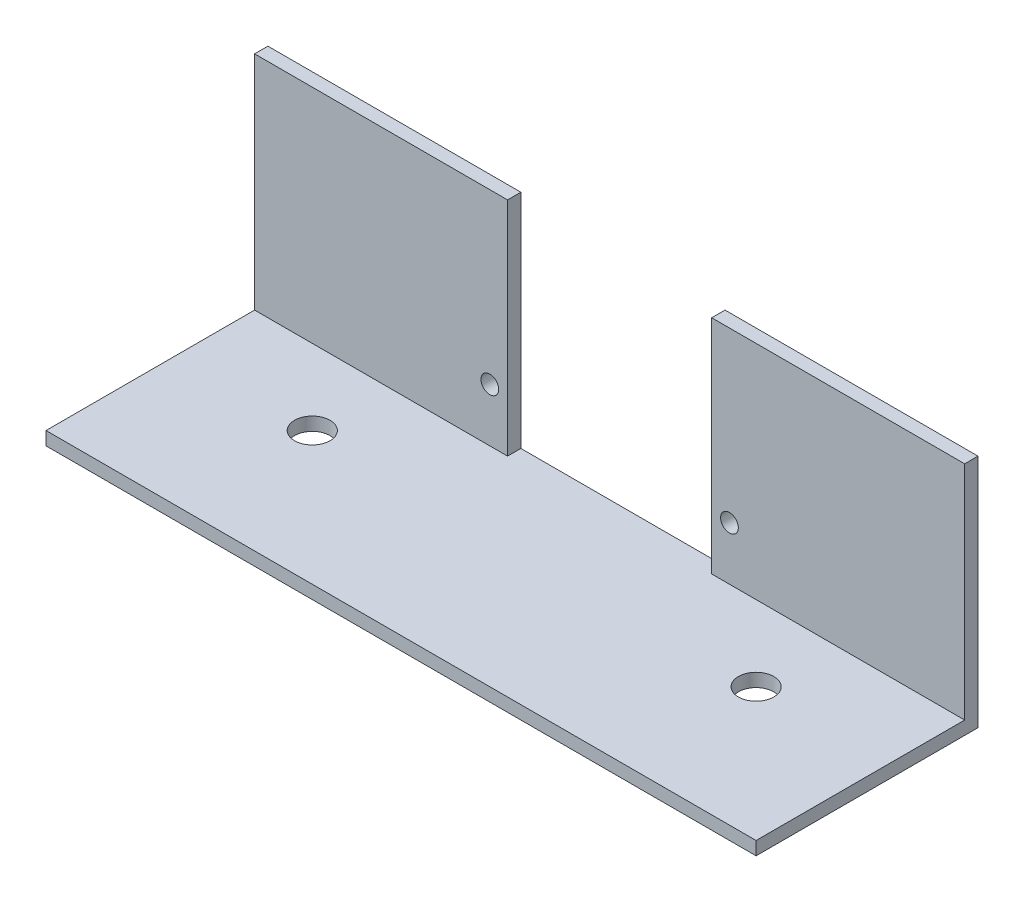
ISO-10303-21;
HEADER;
FILE_DESCRIPTION(('STEP AP214'),'2;1');
FILE_NAME('part.step','',(''),(''),'','','');
FILE_SCHEMA(('AUTOMOTIVE_DESIGN { 1 0 10303 214 1 1 1 1 }'));
ENDSEC;
DATA;
#1=APPLICATION_CONTEXT('core data for automotive mechanical design processes');
#2=APPLICATION_PROTOCOL_DEFINITION('international standard','automotive_design',2000,#1);
#3=PRODUCT_CONTEXT('',#1,'mechanical');
#4=PRODUCT('Part','Part','',(#3));
#5=PRODUCT_RELATED_PRODUCT_CATEGORY('part','',(#4));
#6=PRODUCT_DEFINITION_FORMATION('','',#4);
#7=PRODUCT_DEFINITION_CONTEXT('part definition',#1,'design');
#8=PRODUCT_DEFINITION('design','',#6,#7);
#9=PRODUCT_DEFINITION_SHAPE('','',#8);
#10=(LENGTH_UNIT() NAMED_UNIT(*) SI_UNIT(.MILLI.,.METRE.));
#11=(NAMED_UNIT(*) PLANE_ANGLE_UNIT() SI_UNIT($,.RADIAN.));
#12=(NAMED_UNIT(*) SI_UNIT($,.STERADIAN.) SOLID_ANGLE_UNIT());
#13=UNCERTAINTY_MEASURE_WITH_UNIT(LENGTH_MEASURE(1.E-05),#10,'distance_accuracy_value','');
#14=(GEOMETRIC_REPRESENTATION_CONTEXT(3) GLOBAL_UNCERTAINTY_ASSIGNED_CONTEXT((#13)) GLOBAL_UNIT_ASSIGNED_CONTEXT((#10,
#11,#12)) REPRESENTATION_CONTEXT('',''));
#15=CARTESIAN_POINT('',(0.,0.,0.));
#16=DIRECTION('',(0.,0.,1.));
#17=DIRECTION('',(1.,0.,0.));
#18=AXIS2_PLACEMENT_3D('',#15,#16,#17);
#19=CARTESIAN_POINT('',(0.,1.5,0.));
#20=DIRECTION('',(0.,1.,0.));
#21=DIRECTION('',(0.,0.,1.));
#22=AXIS2_PLACEMENT_3D('',#19,#20,#21);
#23=PLANE('',#22);
#24=CARTESIAN_POINT('',(-25.,1.5,-2.50000000000001));
#25=DIRECTION('',(0.,1.,0.));
#26=DIRECTION('',(0.,0.,1.));
#27=AXIS2_PLACEMENT_3D('',#24,#25,#26);
#28=CIRCLE('',#27,2.);
#29=CARTESIAN_POINT('',(-25.,1.5,-0.500000000000004));
#30=VERTEX_POINT('',#29);
#31=EDGE_CURVE('E200',#30,#30,#28,.T.);
#32=ORIENTED_EDGE('',*,*,#31,.F.);
#33=EDGE_LOOP('',(#32));
#34=FACE_BOUND('',#33,.T.);
#35=CARTESIAN_POINT('',(25.,1.5,-2.50000000000001));
#36=DIRECTION('',(0.,1.,0.));
#37=DIRECTION('',(0.,0.,1.));
#38=AXIS2_PLACEMENT_3D('',#35,#36,#37);
#39=CIRCLE('',#38,2.);
#40=CARTESIAN_POINT('',(25.,1.5,-0.500000000000008));
#41=VERTEX_POINT('',#40);
#42=EDGE_CURVE('E192',#41,#41,#39,.T.);
#43=ORIENTED_EDGE('',*,*,#42,.F.);
#44=EDGE_LOOP('',(#43));
#45=FACE_BOUND('',#44,.T.);
#46=DIRECTION('',(1.,0.,0.));
#47=VECTOR('',#46,1.);
#48=CARTESIAN_POINT('',(11.5,1.5,-11.));
#49=LINE('',#48,#47);
#50=CARTESIAN_POINT('',(11.5,1.5,-11.));
#51=VERTEX_POINT('',#50);
#52=CARTESIAN_POINT('',(40.,1.5,-11.));
#53=VERTEX_POINT('',#52);
#54=EDGE_CURVE('E55',#51,#53,#49,.T.);
#55=ORIENTED_EDGE('',*,*,#54,.F.);
#56=DIRECTION('',(0.,0.,1.));
#57=VECTOR('',#56,1.);
#58=CARTESIAN_POINT('',(11.5,1.5,-12.5));
#59=LINE('',#58,#57);
#60=CARTESIAN_POINT('',(11.5,1.5,-12.5));
#61=VERTEX_POINT('',#60);
#62=EDGE_CURVE('E129',#61,#51,#59,.T.);
#63=ORIENTED_EDGE('',*,*,#62,.F.);
#64=DIRECTION('',(-1.,0.,0.));
#65=VECTOR('',#64,1.);
#66=CARTESIAN_POINT('',(-40.,1.5,-12.5));
#67=LINE('',#66,#65);
#68=CARTESIAN_POINT('',(-11.5,1.5,-12.5));
#69=VERTEX_POINT('',#68);
#70=EDGE_CURVE('E116',#61,#69,#67,.T.);
#71=ORIENTED_EDGE('',*,*,#70,.T.);
#72=DIRECTION('',(0.,0.,1.));
#73=VECTOR('',#72,1.);
#74=CARTESIAN_POINT('',(-11.5,1.5,-12.5));
#75=LINE('',#74,#73);
#76=CARTESIAN_POINT('',(-11.5,1.5,-11.));
#77=VERTEX_POINT('',#76);
#78=EDGE_CURVE('E166',#69,#77,#75,.T.);
#79=ORIENTED_EDGE('',*,*,#78,.T.);
#80=DIRECTION('',(1.,0.,0.));
#81=VECTOR('',#80,1.);
#82=CARTESIAN_POINT('',(-40.,1.5,-11.));
#83=LINE('',#82,#81);
#84=CARTESIAN_POINT('',(-40.,1.5,-11.));
#85=VERTEX_POINT('',#84);
#86=EDGE_CURVE('E133',#85,#77,#83,.T.);
#87=ORIENTED_EDGE('',*,*,#86,.F.);
#88=DIRECTION('',(0.,0.,1.));
#89=VECTOR('',#88,1.);
#90=CARTESIAN_POINT('',(-40.,1.5,-12.5));
#91=LINE('',#90,#89);
#92=CARTESIAN_POINT('',(-40.,1.5,12.5));
#93=VERTEX_POINT('',#92);
#94=EDGE_CURVE('E126',#85,#93,#91,.T.);
#95=ORIENTED_EDGE('',*,*,#94,.T.);
#96=DIRECTION('',(1.,0.,0.));
#97=VECTOR('',#96,1.);
#98=CARTESIAN_POINT('',(-40.,1.5,12.5));
#99=LINE('',#98,#97);
#100=CARTESIAN_POINT('',(40.,1.5,12.5));
#101=VERTEX_POINT('',#100);
#102=EDGE_CURVE('E213',#93,#101,#99,.T.);
#103=ORIENTED_EDGE('',*,*,#102,.T.);
#104=DIRECTION('',(0.,0.,-1.));
#105=VECTOR('',#104,1.);
#106=CARTESIAN_POINT('',(40.,1.5,-12.5));
#107=LINE('',#106,#105);
#108=EDGE_CURVE('E60',#101,#53,#107,.T.);
#109=ORIENTED_EDGE('',*,*,#108,.T.);
#110=EDGE_LOOP('',(#55,#63,#71,#79,#87,#95,#103,#109));
#111=FACE_BOUND('',#110,.T.);
#112=ADVANCED_FACE('F39',(#34,#45,#111),#23,.T.);
#113=CARTESIAN_POINT('',(0.,0.,0.));
#114=DIRECTION('',(0.,1.,0.));
#115=DIRECTION('',(0.,0.,1.));
#116=AXIS2_PLACEMENT_3D('',#113,#114,#115);
#117=PLANE('',#116);
#118=DIRECTION('',(0.,0.,-1.));
#119=VECTOR('',#118,1.);
#120=CARTESIAN_POINT('',(40.,0.,-12.5));
#121=LINE('',#120,#119);
#122=CARTESIAN_POINT('',(40.,0.,12.5));
#123=VERTEX_POINT('',#122);
#124=CARTESIAN_POINT('',(40.,0.,-12.5));
#125=VERTEX_POINT('',#124);
#126=EDGE_CURVE('E204',#123,#125,#121,.T.);
#127=ORIENTED_EDGE('',*,*,#126,.F.);
#128=DIRECTION('',(1.,0.,0.));
#129=VECTOR('',#128,1.);
#130=CARTESIAN_POINT('',(-40.,0.,12.5));
#131=LINE('',#130,#129);
#132=CARTESIAN_POINT('',(-40.,0.,12.5));
#133=VERTEX_POINT('',#132);
#134=EDGE_CURVE('E209',#133,#123,#131,.T.);
#135=ORIENTED_EDGE('',*,*,#134,.F.);
#136=DIRECTION('',(0.,0.,1.));
#137=VECTOR('',#136,1.);
#138=CARTESIAN_POINT('',(-40.,0.,-12.5));
#139=LINE('',#138,#137);
#140=CARTESIAN_POINT('',(-40.,0.,-12.5));
#141=VERTEX_POINT('',#140);
#142=EDGE_CURVE('E223',#141,#133,#139,.T.);
#143=ORIENTED_EDGE('',*,*,#142,.F.);
#144=DIRECTION('',(-1.,0.,0.));
#145=VECTOR('',#144,1.);
#146=CARTESIAN_POINT('',(-40.,0.,-12.5));
#147=LINE('',#146,#145);
#148=EDGE_CURVE('E220',#125,#141,#147,.T.);
#149=ORIENTED_EDGE('',*,*,#148,.F.);
#150=EDGE_LOOP('',(#127,#135,#143,#149));
#151=FACE_BOUND('',#150,.T.);
#152=CARTESIAN_POINT('',(-25.,0.,-2.50000000000001));
#153=DIRECTION('',(0.,1.,0.));
#154=DIRECTION('',(0.,0.,1.));
#155=AXIS2_PLACEMENT_3D('',#152,#153,#154);
#156=CIRCLE('',#155,2.);
#157=CARTESIAN_POINT('',(-25.,0.,-0.500000000000004));
#158=VERTEX_POINT('',#157);
#159=EDGE_CURVE('E196',#158,#158,#156,.T.);
#160=ORIENTED_EDGE('',*,*,#159,.T.);
#161=EDGE_LOOP('',(#160));
#162=FACE_BOUND('',#161,.T.);
#163=CARTESIAN_POINT('',(25.,0.,-2.50000000000001));
#164=DIRECTION('',(0.,1.,0.));
#165=DIRECTION('',(0.,0.,1.));
#166=AXIS2_PLACEMENT_3D('',#163,#164,#165);
#167=CIRCLE('',#166,2.);
#168=CARTESIAN_POINT('',(25.,0.,-0.500000000000008));
#169=VERTEX_POINT('',#168);
#170=EDGE_CURVE('E191',#169,#169,#167,.T.);
#171=ORIENTED_EDGE('',*,*,#170,.T.);
#172=EDGE_LOOP('',(#171));
#173=FACE_BOUND('',#172,.T.);
#174=ADVANCED_FACE('F246',(#151,#162,#173),#117,.F.);
#175=CARTESIAN_POINT('',(40.,1.5,-12.5));
#176=DIRECTION('',(-1.,0.,0.));
#177=DIRECTION('',(0.,0.,1.));
#178=AXIS2_PLACEMENT_3D('',#175,#176,#177);
#179=PLANE('',#178);
#180=ORIENTED_EDGE('',*,*,#126,.T.);
#181=DIRECTION('',(0.,-1.,0.));
#182=VECTOR('',#181,1.);
#183=CARTESIAN_POINT('',(40.,1.5,-12.5));
#184=LINE('',#183,#182);
#185=CARTESIAN_POINT('',(40.,26.5,-12.5));
#186=VERTEX_POINT('',#185);
#187=EDGE_CURVE('E11',#186,#125,#184,.T.);
#188=ORIENTED_EDGE('',*,*,#187,.F.);
#189=DIRECTION('',(0.,0.,1.));
#190=VECTOR('',#189,1.);
#191=CARTESIAN_POINT('',(40.,26.5,-12.5));
#192=LINE('',#191,#190);
#193=CARTESIAN_POINT('',(40.,26.5,-11.));
#194=VERTEX_POINT('',#193);
#195=EDGE_CURVE('E145',#186,#194,#192,.T.);
#196=ORIENTED_EDGE('',*,*,#195,.T.);
#197=DIRECTION('',(0.,-1.,0.));
#198=VECTOR('',#197,1.);
#199=CARTESIAN_POINT('',(40.,26.5,-11.));
#200=LINE('',#199,#198);
#201=EDGE_CURVE('E141',#194,#53,#200,.T.);
#202=ORIENTED_EDGE('',*,*,#201,.T.);
#203=ORIENTED_EDGE('',*,*,#108,.F.);
#204=DIRECTION('',(0.,-1.,0.));
#205=VECTOR('',#204,1.);
#206=CARTESIAN_POINT('',(40.,1.5,12.5));
#207=LINE('',#206,#205);
#208=EDGE_CURVE('E216',#101,#123,#207,.T.);
#209=ORIENTED_EDGE('',*,*,#208,.T.);
#210=EDGE_LOOP('',(#180,#188,#196,#202,#203,#209));
#211=FACE_BOUND('',#210,.T.);
#212=ADVANCED_FACE('F41',(#211),#179,.F.);
#213=CARTESIAN_POINT('',(-40.,1.5,-12.5));
#214=DIRECTION('',(0.,0.,1.));
#215=DIRECTION('',(1.,0.,0.));
#216=AXIS2_PLACEMENT_3D('',#213,#214,#215);
#217=PLANE('',#216);
#218=CARTESIAN_POINT('',(-13.5,7.5,-12.5));
#219=DIRECTION('',(0.,0.,-1.));
#220=DIRECTION('',(-1.,0.,0.));
#221=AXIS2_PLACEMENT_3D('',#218,#219,#220);
#222=CIRCLE('',#221,1.);
#223=CARTESIAN_POINT('',(-14.5,7.5,-12.5));
#224=VERTEX_POINT('',#223);
#225=EDGE_CURVE('E261',#224,#224,#222,.T.);
#226=ORIENTED_EDGE('',*,*,#225,.F.);
#227=EDGE_LOOP('',(#226));
#228=FACE_BOUND('',#227,.T.);
#229=CARTESIAN_POINT('',(13.5,7.5,-12.5));
#230=DIRECTION('',(0.,0.,-1.));
#231=DIRECTION('',(1.,0.,0.));
#232=AXIS2_PLACEMENT_3D('',#229,#230,#231);
#233=CIRCLE('',#232,1.);
#234=CARTESIAN_POINT('',(14.5,7.5,-12.5));
#235=VERTEX_POINT('',#234);
#236=EDGE_CURVE('E268',#235,#235,#233,.T.);
#237=ORIENTED_EDGE('',*,*,#236,.F.);
#238=EDGE_LOOP('',(#237));
#239=FACE_BOUND('',#238,.T.);
#240=ORIENTED_EDGE('',*,*,#148,.T.);
#241=DIRECTION('',(0.,-1.,0.));
#242=VECTOR('',#241,1.);
#243=CARTESIAN_POINT('',(-40.,1.5,-12.5));
#244=LINE('',#243,#242);
#245=CARTESIAN_POINT('',(-40.,26.5,-12.5));
#246=VERTEX_POINT('',#245);
#247=EDGE_CURVE('E48',#246,#141,#244,.T.);
#248=ORIENTED_EDGE('',*,*,#247,.F.);
#249=DIRECTION('',(1.,0.,0.));
#250=VECTOR('',#249,1.);
#251=CARTESIAN_POINT('',(-40.,26.5,-12.5));
#252=LINE('',#251,#250);
#253=CARTESIAN_POINT('',(-11.5,26.5,-12.5));
#254=VERTEX_POINT('',#253);
#255=EDGE_CURVE('E173',#246,#254,#252,.T.);
#256=ORIENTED_EDGE('',*,*,#255,.T.);
#257=DIRECTION('',(0.,-1.,0.));
#258=VECTOR('',#257,1.);
#259=CARTESIAN_POINT('',(-11.5,26.5,-12.5));
#260=LINE('',#259,#258);
#261=EDGE_CURVE('E123',#254,#69,#260,.T.);
#262=ORIENTED_EDGE('',*,*,#261,.T.);
#263=ORIENTED_EDGE('',*,*,#70,.F.);
#264=DIRECTION('',(0.,-1.,0.));
#265=VECTOR('',#264,1.);
#266=CARTESIAN_POINT('',(11.5,26.5,-12.5));
#267=LINE('',#266,#265);
#268=CARTESIAN_POINT('',(11.5,26.5,-12.5));
#269=VERTEX_POINT('',#268);
#270=EDGE_CURVE('E120',#269,#61,#267,.T.);
#271=ORIENTED_EDGE('',*,*,#270,.F.);
#272=DIRECTION('',(1.,0.,0.));
#273=VECTOR('',#272,1.);
#274=CARTESIAN_POINT('',(11.5,26.5,-12.5));
#275=LINE('',#274,#273);
#276=EDGE_CURVE('E140',#269,#186,#275,.T.);
#277=ORIENTED_EDGE('',*,*,#276,.T.);
#278=ORIENTED_EDGE('',*,*,#187,.T.);
#279=EDGE_LOOP('',(#240,#248,#256,#262,#263,#271,#277,#278));
#280=FACE_BOUND('',#279,.T.);
#281=ADVANCED_FACE('F117',(#228,#239,#280),#217,.F.);
#282=CARTESIAN_POINT('',(-40.,1.5,-12.5));
#283=DIRECTION('',(1.,0.,0.));
#284=DIRECTION('',(0.,0.,-1.));
#285=AXIS2_PLACEMENT_3D('',#282,#283,#284);
#286=PLANE('',#285);
#287=ORIENTED_EDGE('',*,*,#142,.T.);
#288=DIRECTION('',(0.,-1.,0.));
#289=VECTOR('',#288,1.);
#290=CARTESIAN_POINT('',(-40.,1.5,12.5));
#291=LINE('',#290,#289);
#292=EDGE_CURVE('E231',#93,#133,#291,.T.);
#293=ORIENTED_EDGE('',*,*,#292,.F.);
#294=ORIENTED_EDGE('',*,*,#94,.F.);
#295=DIRECTION('',(0.,-1.,0.));
#296=VECTOR('',#295,1.);
#297=CARTESIAN_POINT('',(-40.,26.5,-11.));
#298=LINE('',#297,#296);
#299=CARTESIAN_POINT('',(-40.,26.5,-11.));
#300=VERTEX_POINT('',#299);
#301=EDGE_CURVE('E187',#300,#85,#298,.T.);
#302=ORIENTED_EDGE('',*,*,#301,.F.);
#303=DIRECTION('',(0.,0.,1.));
#304=VECTOR('',#303,1.);
#305=CARTESIAN_POINT('',(-40.,26.5,-12.5));
#306=LINE('',#305,#304);
#307=EDGE_CURVE('E161',#246,#300,#306,.T.);
#308=ORIENTED_EDGE('',*,*,#307,.F.);
#309=ORIENTED_EDGE('',*,*,#247,.T.);
#310=EDGE_LOOP('',(#287,#293,#294,#302,#308,#309));
#311=FACE_BOUND('',#310,.T.);
#312=ADVANCED_FACE('F239',(#311),#286,.F.);
#313=CARTESIAN_POINT('',(-40.,1.5,12.5));
#314=DIRECTION('',(0.,0.,-1.));
#315=DIRECTION('',(-1.,0.,0.));
#316=AXIS2_PLACEMENT_3D('',#313,#314,#315);
#317=PLANE('',#316);
#318=ORIENTED_EDGE('',*,*,#134,.T.);
#319=ORIENTED_EDGE('',*,*,#208,.F.);
#320=ORIENTED_EDGE('',*,*,#102,.F.);
#321=ORIENTED_EDGE('',*,*,#292,.T.);
#322=EDGE_LOOP('',(#318,#319,#320,#321));
#323=FACE_BOUND('',#322,.T.);
#324=ADVANCED_FACE('F250',(#323),#317,.F.);
#325=CARTESIAN_POINT('',(-25.,1.5,-2.50000000000001));
#326=DIRECTION('',(0.,-1.,0.));
#327=DIRECTION('',(0.,0.,-1.));
#328=AXIS2_PLACEMENT_3D('',#325,#326,#327);
#329=CYLINDRICAL_SURFACE('',#328,2.);
#330=ORIENTED_EDGE('',*,*,#31,.T.);
#331=EDGE_LOOP('',(#330));
#332=FACE_BOUND('',#331,.T.);
#333=ORIENTED_EDGE('',*,*,#159,.F.);
#334=EDGE_LOOP('',(#333));
#335=FACE_BOUND('',#334,.T.);
#336=ADVANCED_FACE('F306',(#332,#335),#329,.F.);
#337=CARTESIAN_POINT('',(25.,1.5,-2.50000000000001));
#338=DIRECTION('',(0.,-1.,0.));
#339=DIRECTION('',(0.,0.,-1.));
#340=AXIS2_PLACEMENT_3D('',#337,#338,#339);
#341=CYLINDRICAL_SURFACE('',#340,2.);
#342=ORIENTED_EDGE('',*,*,#42,.T.);
#343=EDGE_LOOP('',(#342));
#344=FACE_BOUND('',#343,.T.);
#345=ORIENTED_EDGE('',*,*,#170,.F.);
#346=EDGE_LOOP('',(#345));
#347=FACE_BOUND('',#346,.T.);
#348=ADVANCED_FACE('F330',(#344,#347),#341,.F.);
#349=CARTESIAN_POINT('',(-40.,26.5,-11.));
#350=DIRECTION('',(0.,0.,-1.));
#351=DIRECTION('',(-1.,0.,0.));
#352=AXIS2_PLACEMENT_3D('',#349,#350,#351);
#353=PLANE('',#352);
#354=CARTESIAN_POINT('',(-13.5,7.5,-11.));
#355=DIRECTION('',(0.,0.,-1.));
#356=DIRECTION('',(-1.,0.,0.));
#357=AXIS2_PLACEMENT_3D('',#354,#355,#356);
#358=CIRCLE('',#357,1.);
#359=CARTESIAN_POINT('',(-14.5,7.5,-11.));
#360=VERTEX_POINT('',#359);
#361=EDGE_CURVE('E258',#360,#360,#358,.F.);
#362=ORIENTED_EDGE('',*,*,#361,.F.);
#363=EDGE_LOOP('',(#362));
#364=FACE_BOUND('',#363,.T.);
#365=ORIENTED_EDGE('',*,*,#86,.T.);
#366=DIRECTION('',(0.,-1.,0.));
#367=VECTOR('',#366,1.);
#368=CARTESIAN_POINT('',(-11.5,26.5,-11.));
#369=LINE('',#368,#367);
#370=CARTESIAN_POINT('',(-11.5,26.5,-11.));
#371=VERTEX_POINT('',#370);
#372=EDGE_CURVE('E183',#371,#77,#369,.T.);
#373=ORIENTED_EDGE('',*,*,#372,.F.);
#374=DIRECTION('',(1.,0.,0.));
#375=VECTOR('',#374,1.);
#376=CARTESIAN_POINT('',(-40.,26.5,-11.));
#377=LINE('',#376,#375);
#378=EDGE_CURVE('E165',#300,#371,#377,.T.);
#379=ORIENTED_EDGE('',*,*,#378,.F.);
#380=ORIENTED_EDGE('',*,*,#301,.T.);
#381=EDGE_LOOP('',(#365,#373,#379,#380));
#382=FACE_BOUND('',#381,.T.);
#383=ADVANCED_FACE('F337',(#364,#382),#353,.F.);
#384=CARTESIAN_POINT('',(-11.5,26.5,-12.5));
#385=DIRECTION('',(1.,0.,0.));
#386=DIRECTION('',(0.,0.,-1.));
#387=AXIS2_PLACEMENT_3D('',#384,#385,#386);
#388=PLANE('',#387);
#389=ORIENTED_EDGE('',*,*,#78,.F.);
#390=ORIENTED_EDGE('',*,*,#261,.F.);
#391=DIRECTION('',(0.,0.,1.));
#392=VECTOR('',#391,1.);
#393=CARTESIAN_POINT('',(-11.5,26.5,-12.5));
#394=LINE('',#393,#392);
#395=EDGE_CURVE('E169',#254,#371,#394,.T.);
#396=ORIENTED_EDGE('',*,*,#395,.T.);
#397=ORIENTED_EDGE('',*,*,#372,.T.);
#398=EDGE_LOOP('',(#389,#390,#396,#397));
#399=FACE_BOUND('',#398,.T.);
#400=ADVANCED_FACE('F344',(#399),#388,.T.);
#401=CARTESIAN_POINT('',(0.,26.5,0.));
#402=DIRECTION('',(0.,1.,0.));
#403=DIRECTION('',(0.,0.,1.));
#404=AXIS2_PLACEMENT_3D('',#401,#402,#403);
#405=PLANE('',#404);
#406=ORIENTED_EDGE('',*,*,#307,.T.);
#407=ORIENTED_EDGE('',*,*,#378,.T.);
#408=ORIENTED_EDGE('',*,*,#395,.F.);
#409=ORIENTED_EDGE('',*,*,#255,.F.);
#410=EDGE_LOOP('',(#406,#407,#408,#409));
#411=FACE_BOUND('',#410,.T.);
#412=ADVANCED_FACE('F352',(#411),#405,.T.);
#413=CARTESIAN_POINT('',(11.5,26.5,-12.5));
#414=DIRECTION('',(1.,0.,0.));
#415=DIRECTION('',(0.,0.,-1.));
#416=AXIS2_PLACEMENT_3D('',#413,#414,#415);
#417=PLANE('',#416);
#418=ORIENTED_EDGE('',*,*,#62,.T.);
#419=DIRECTION('',(0.,-1.,0.));
#420=VECTOR('',#419,1.);
#421=CARTESIAN_POINT('',(11.5,26.5,-11.));
#422=LINE('',#421,#420);
#423=CARTESIAN_POINT('',(11.5,26.5,-11.));
#424=VERTEX_POINT('',#423);
#425=EDGE_CURVE('E147',#424,#51,#422,.T.);
#426=ORIENTED_EDGE('',*,*,#425,.F.);
#427=DIRECTION('',(0.,0.,1.));
#428=VECTOR('',#427,1.);
#429=CARTESIAN_POINT('',(11.5,26.5,-12.5));
#430=LINE('',#429,#428);
#431=EDGE_CURVE('E137',#269,#424,#430,.T.);
#432=ORIENTED_EDGE('',*,*,#431,.F.);
#433=ORIENTED_EDGE('',*,*,#270,.T.);
#434=EDGE_LOOP('',(#418,#426,#432,#433));
#435=FACE_BOUND('',#434,.T.);
#436=ADVANCED_FACE('F135',(#435),#417,.F.);
#437=CARTESIAN_POINT('',(11.5,26.5,-11.));
#438=DIRECTION('',(0.,0.,-1.));
#439=DIRECTION('',(-1.,0.,0.));
#440=AXIS2_PLACEMENT_3D('',#437,#438,#439);
#441=PLANE('',#440);
#442=CARTESIAN_POINT('',(13.5,7.5,-11.));
#443=DIRECTION('',(0.,0.,-1.));
#444=DIRECTION('',(-1.,0.,0.));
#445=AXIS2_PLACEMENT_3D('',#442,#443,#444);
#446=CIRCLE('',#445,1.);
#447=CARTESIAN_POINT('',(12.5,7.5,-11.));
#448=VERTEX_POINT('',#447);
#449=EDGE_CURVE('E264',#448,#448,#446,.F.);
#450=ORIENTED_EDGE('',*,*,#449,.F.);
#451=EDGE_LOOP('',(#450));
#452=FACE_BOUND('',#451,.T.);
#453=ORIENTED_EDGE('',*,*,#54,.T.);
#454=ORIENTED_EDGE('',*,*,#201,.F.);
#455=DIRECTION('',(1.,0.,0.));
#456=VECTOR('',#455,1.);
#457=CARTESIAN_POINT('',(11.5,26.5,-11.));
#458=LINE('',#457,#456);
#459=EDGE_CURVE('E156',#424,#194,#458,.T.);
#460=ORIENTED_EDGE('',*,*,#459,.F.);
#461=ORIENTED_EDGE('',*,*,#425,.T.);
#462=EDGE_LOOP('',(#453,#454,#460,#461));
#463=FACE_BOUND('',#462,.T.);
#464=ADVANCED_FACE('F256',(#452,#463),#441,.F.);
#465=CARTESIAN_POINT('',(0.,26.5,0.));
#466=DIRECTION('',(0.,1.,0.));
#467=DIRECTION('',(0.,0.,1.));
#468=AXIS2_PLACEMENT_3D('',#465,#466,#467);
#469=PLANE('',#468);
#470=ORIENTED_EDGE('',*,*,#431,.T.);
#471=ORIENTED_EDGE('',*,*,#459,.T.);
#472=ORIENTED_EDGE('',*,*,#195,.F.);
#473=ORIENTED_EDGE('',*,*,#276,.F.);
#474=EDGE_LOOP('',(#470,#471,#472,#473));
#475=FACE_BOUND('',#474,.T.);
#476=ADVANCED_FACE('F284',(#475),#469,.T.);
#477=CARTESIAN_POINT('',(13.5,7.5,-8.17157287525383));
#478=DIRECTION('',(0.,0.,-1.));
#479=DIRECTION('',(-1.,0.,0.));
#480=AXIS2_PLACEMENT_3D('',#477,#478,#479);
#481=CYLINDRICAL_SURFACE('',#480,1.);
#482=ORIENTED_EDGE('',*,*,#449,.T.);
#483=EDGE_LOOP('',(#482));
#484=FACE_BOUND('',#483,.T.);
#485=ORIENTED_EDGE('',*,*,#236,.T.);
#486=EDGE_LOOP('',(#485));
#487=FACE_BOUND('',#486,.T.);
#488=ADVANCED_FACE('F282',(#484,#487),#481,.F.);
#489=CARTESIAN_POINT('',(-13.5,7.5,-8.17157287525383));
#490=DIRECTION('',(0.,0.,-1.));
#491=DIRECTION('',(-1.,0.,0.));
#492=AXIS2_PLACEMENT_3D('',#489,#490,#491);
#493=CYLINDRICAL_SURFACE('',#492,1.);
#494=ORIENTED_EDGE('',*,*,#361,.T.);
#495=EDGE_LOOP('',(#494));
#496=FACE_BOUND('',#495,.T.);
#497=ORIENTED_EDGE('',*,*,#225,.T.);
#498=EDGE_LOOP('',(#497));
#499=FACE_BOUND('',#498,.T.);
#500=ADVANCED_FACE('F276',(#496,#499),#493,.F.);
#501=CLOSED_SHELL('',(#112,#174,#212,#281,#312,#324,#336,#348,#383,#400,#412,#436,#464,#476,
#488,#500));
#502=MANIFOLD_SOLID_BREP('B2',#501);
#503=ADVANCED_BREP_SHAPE_REPRESENTATION('',(#18,#502),#14);
#504=SHAPE_DEFINITION_REPRESENTATION(#9,#503);
ENDSEC;
END-ISO-10303-21;
